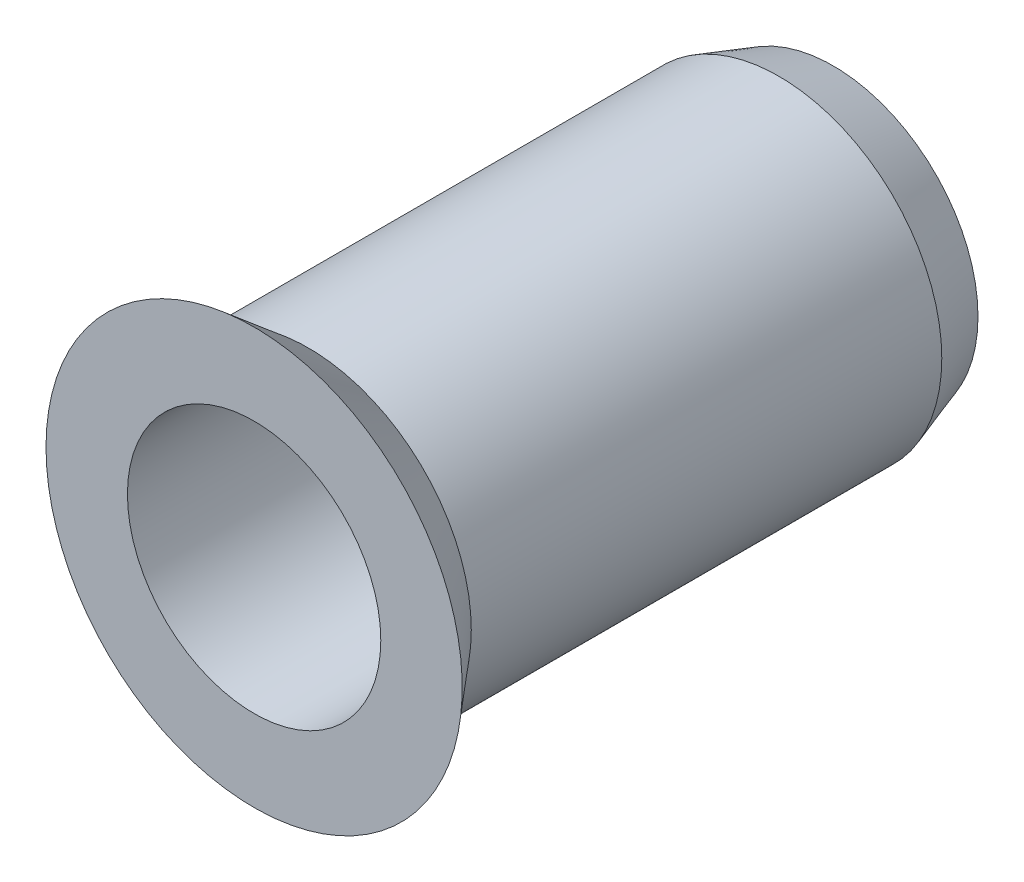
ISO-10303-21;
HEADER;
FILE_DESCRIPTION(('STEP AP214'),'2;1');
FILE_NAME('part.step','',(''),(''),'','','');
FILE_SCHEMA(('AUTOMOTIVE_DESIGN { 1 0 10303 214 1 1 1 1 }'));
ENDSEC;
DATA;
#1=APPLICATION_CONTEXT('core data for automotive mechanical design processes');
#2=APPLICATION_PROTOCOL_DEFINITION('international standard','automotive_design',2000,#1);
#3=PRODUCT_CONTEXT('',#1,'mechanical');
#4=PRODUCT('Part','Part','',(#3));
#5=PRODUCT_RELATED_PRODUCT_CATEGORY('part','',(#4));
#6=PRODUCT_DEFINITION_FORMATION('','',#4);
#7=PRODUCT_DEFINITION_CONTEXT('part definition',#1,'design');
#8=PRODUCT_DEFINITION('design','',#6,#7);
#9=PRODUCT_DEFINITION_SHAPE('','',#8);
#10=(LENGTH_UNIT() NAMED_UNIT(*) SI_UNIT(.MILLI.,.METRE.));
#11=(NAMED_UNIT(*) PLANE_ANGLE_UNIT() SI_UNIT($,.RADIAN.));
#12=(NAMED_UNIT(*) SI_UNIT($,.STERADIAN.) SOLID_ANGLE_UNIT());
#13=UNCERTAINTY_MEASURE_WITH_UNIT(LENGTH_MEASURE(1.E-05),#10,'distance_accuracy_value','');
#14=(GEOMETRIC_REPRESENTATION_CONTEXT(3) GLOBAL_UNCERTAINTY_ASSIGNED_CONTEXT((#13)) GLOBAL_UNIT_ASSIGNED_CONTEXT((#10,
#11,#12)) REPRESENTATION_CONTEXT('',''));
#15=CARTESIAN_POINT('',(0.,0.,0.));
#16=DIRECTION('',(0.,0.,1.));
#17=DIRECTION('',(1.,0.,0.));
#18=AXIS2_PLACEMENT_3D('',#15,#16,#17);
#19=CARTESIAN_POINT('',(0.,0.,16.0000000009859));
#20=DIRECTION('',(0.,0.,-1.));
#21=DIRECTION('',(-1.,0.,0.));
#22=AXIS2_PLACEMENT_3D('',#19,#20,#21);
#23=CYLINDRICAL_SURFACE('',#22,3.5);
#24=CARTESIAN_POINT('',(0.,0.,9.00000000000001));
#25=DIRECTION('',(0.,0.,-1.));
#26=DIRECTION('',(-1.,0.,0.));
#27=AXIS2_PLACEMENT_3D('',#24,#25,#26);
#28=CIRCLE('',#27,3.5);
#29=CARTESIAN_POINT('',(-3.5,0.,9.00000000000001));
#30=VERTEX_POINT('',#29);
#31=EDGE_CURVE('E10',#30,#30,#28,.T.);
#32=ORIENTED_EDGE('',*,*,#31,.T.);
#33=EDGE_LOOP('',(#32));
#34=FACE_BOUND('',#33,.T.);
#35=CARTESIAN_POINT('',(0.,0.,16.0000000020375));
#36=DIRECTION('',(0.,0.,-1.));
#37=DIRECTION('',(-1.,0.,0.));
#38=AXIS2_PLACEMENT_3D('',#35,#36,#37);
#39=CIRCLE('',#38,3.5);
#40=CARTESIAN_POINT('',(-3.5,0.,16.0000000020375));
#41=VERTEX_POINT('',#40);
#42=EDGE_CURVE('E78',#41,#41,#39,.T.);
#43=ORIENTED_EDGE('',*,*,#42,.F.);
#44=EDGE_LOOP('',(#43));
#45=FACE_BOUND('',#44,.T.);
#46=ADVANCED_FACE('F40',(#34,#45),#23,.F.);
#47=CARTESIAN_POINT('',(0.,0.,9.00000000000001));
#48=DIRECTION('',(0.,0.,1.));
#49=DIRECTION('',(1.,0.,0.));
#50=AXIS2_PLACEMENT_3D('',#47,#48,#49);
#51=CONICAL_SURFACE('',#50,3.5,1.02974425753921);
#52=CARTESIAN_POINT('',(0.,0.,8.39913937983283));
#53=DIRECTION('',(0.,0.,-1.));
#54=DIRECTION('',(-1.,0.,0.));
#55=AXIS2_PLACEMENT_3D('',#52,#53,#54);
#56=CIRCLE('',#55,2.50000000067985);
#57=CARTESIAN_POINT('',(-2.50000000067985,0.,8.39913937983283));
#58=VERTEX_POINT('',#57);
#59=EDGE_CURVE('E47',#58,#58,#56,.T.);
#60=ORIENTED_EDGE('',*,*,#59,.T.);
#61=EDGE_LOOP('',(#60));
#62=FACE_BOUND('',#61,.T.);
#63=ORIENTED_EDGE('',*,*,#31,.F.);
#64=EDGE_LOOP('',(#63));
#65=FACE_BOUND('',#64,.T.);
#66=ADVANCED_FACE('F89',(#62,#65),#51,.F.);
#67=CARTESIAN_POINT('',(0.,0.,16.0000000009859));
#68=DIRECTION('',(0.,0.,-1.));
#69=DIRECTION('',(-1.,0.,0.));
#70=AXIS2_PLACEMENT_3D('',#67,#68,#69);
#71=CYLINDRICAL_SURFACE('',#70,2.50000000067985);
#72=CARTESIAN_POINT('',(0.,0.,1.00000000088585));
#73=DIRECTION('',(0.,0.,-1.));
#74=DIRECTION('',(-1.,0.,0.));
#75=AXIS2_PLACEMENT_3D('',#72,#73,#74);
#76=CIRCLE('',#75,2.50000000067985);
#77=CARTESIAN_POINT('',(-2.50000000067985,0.,1.00000000088585));
#78=VERTEX_POINT('',#77);
#79=EDGE_CURVE('E55',#78,#78,#76,.T.);
#80=ORIENTED_EDGE('',*,*,#79,.T.);
#81=EDGE_LOOP('',(#80));
#82=FACE_BOUND('',#81,.T.);
#83=ORIENTED_EDGE('',*,*,#59,.F.);
#84=EDGE_LOOP('',(#83));
#85=FACE_BOUND('',#84,.T.);
#86=ADVANCED_FACE('F92',(#82,#85),#71,.F.);
#87=CARTESIAN_POINT('',(0.,0.,1.00000000088585));
#88=DIRECTION('',(0.,0.,-1.));
#89=DIRECTION('',(-1.,0.,0.));
#90=AXIS2_PLACEMENT_3D('',#87,#88,#89);
#91=CONICAL_SURFACE('',#90,2.50000000067985,0.785398163397448);
#92=CARTESIAN_POINT('',(0.,0.,8.81072992342524E-10));
#93=DIRECTION('',(0.,0.,-1.));
#94=DIRECTION('',(-1.,0.,0.));
#95=AXIS2_PLACEMENT_3D('',#92,#93,#94);
#96=CIRCLE('',#95,3.50000000068462);
#97=CARTESIAN_POINT('',(-3.50000000068462,0.,8.81072992342524E-10));
#98=VERTEX_POINT('',#97);
#99=EDGE_CURVE('E61',#98,#98,#96,.T.);
#100=ORIENTED_EDGE('',*,*,#99,.T.);
#101=EDGE_LOOP('',(#100));
#102=FACE_BOUND('',#101,.T.);
#103=ORIENTED_EDGE('',*,*,#79,.F.);
#104=EDGE_LOOP('',(#103));
#105=FACE_BOUND('',#104,.T.);
#106=ADVANCED_FACE('F95',(#102,#105),#91,.F.);
#107=CARTESIAN_POINT('',(3.50000000068462,0.,8.81072992342524E-10));
#108=DIRECTION('',(0.,0.,-1.));
#109=DIRECTION('',(-1.,0.,0.));
#110=AXIS2_PLACEMENT_3D('',#107,#108,#109);
#111=PLANE('',#110);
#112=CARTESIAN_POINT('',(0.,0.,8.81072992342524E-10));
#113=DIRECTION('',(0.,0.,-1.));
#114=DIRECTION('',(-1.,0.,0.));
#115=AXIS2_PLACEMENT_3D('',#112,#113,#114);
#116=CIRCLE('',#115,4.00000000130755);
#117=CARTESIAN_POINT('',(-4.00000000130755,0.,8.81072992342524E-10));
#118=VERTEX_POINT('',#117);
#119=EDGE_CURVE('E66',#118,#118,#116,.T.);
#120=ORIENTED_EDGE('',*,*,#119,.T.);
#121=EDGE_LOOP('',(#120));
#122=FACE_BOUND('',#121,.T.);
#123=ORIENTED_EDGE('',*,*,#99,.F.);
#124=EDGE_LOOP('',(#123));
#125=FACE_BOUND('',#124,.T.);
#126=ADVANCED_FACE('F102',(#122,#125),#111,.T.);
#127=CARTESIAN_POINT('',(0.,0.,8.81072992342524E-10));
#128=DIRECTION('',(0.,0.,1.));
#129=DIRECTION('',(1.,0.,0.));
#130=AXIS2_PLACEMENT_3D('',#127,#128,#129);
#131=CONICAL_SURFACE('',#130,4.00000000130755,0.321750554004332);
#132=CARTESIAN_POINT('',(0.,0.,1.5000000010516));
#133=DIRECTION('',(0.,0.,-1.));
#134=DIRECTION('',(-1.,0.,0.));
#135=AXIS2_PLACEMENT_3D('',#132,#133,#134);
#136=CIRCLE('',#135,4.50000000071054);
#137=CARTESIAN_POINT('',(-4.50000000071054,0.,1.5000000010516));
#138=VERTEX_POINT('',#137);
#139=EDGE_CURVE('E69',#138,#138,#136,.T.);
#140=ORIENTED_EDGE('',*,*,#139,.T.);
#141=EDGE_LOOP('',(#140));
#142=FACE_BOUND('',#141,.T.);
#143=ORIENTED_EDGE('',*,*,#119,.F.);
#144=EDGE_LOOP('',(#143));
#145=FACE_BOUND('',#144,.T.);
#146=ADVANCED_FACE('F106',(#142,#145),#131,.T.);
#147=CARTESIAN_POINT('',(0.,0.,16.0000000009859));
#148=DIRECTION('',(0.,0.,-1.));
#149=DIRECTION('',(-1.,0.,0.));
#150=AXIS2_PLACEMENT_3D('',#147,#148,#149);
#151=CYLINDRICAL_SURFACE('',#150,4.50000000071054);
#152=CARTESIAN_POINT('',(0.,0.,14.5000000010516));
#153=DIRECTION('',(0.,0.,-1.));
#154=DIRECTION('',(-1.,0.,0.));
#155=AXIS2_PLACEMENT_3D('',#152,#153,#154);
#156=CIRCLE('',#155,4.50000000071054);
#157=CARTESIAN_POINT('',(-4.50000000071054,0.,14.5000000010516));
#158=VERTEX_POINT('',#157);
#159=EDGE_CURVE('E72',#158,#158,#156,.T.);
#160=ORIENTED_EDGE('',*,*,#159,.T.);
#161=EDGE_LOOP('',(#160));
#162=FACE_BOUND('',#161,.T.);
#163=ORIENTED_EDGE('',*,*,#139,.F.);
#164=EDGE_LOOP('',(#163));
#165=FACE_BOUND('',#164,.T.);
#166=ADVANCED_FACE('F110',(#162,#165),#151,.T.);
#167=CARTESIAN_POINT('',(0.,0.,14.5000000010516));
#168=DIRECTION('',(0.,0.,1.));
#169=DIRECTION('',(1.,0.,0.));
#170=AXIS2_PLACEMENT_3D('',#167,#168,#169);
#171=CONICAL_SURFACE('',#170,4.50000000071054,0.6947382754174);
#172=CARTESIAN_POINT('',(0.,0.,16.0000000020375));
#173=DIRECTION('',(0.,0.,-1.));
#174=DIRECTION('',(-1.,0.,0.));
#175=AXIS2_PLACEMENT_3D('',#172,#173,#174);
#176=CIRCLE('',#175,5.74999999955139);
#177=CARTESIAN_POINT('',(-5.74999999955139,0.,16.0000000020375));
#178=VERTEX_POINT('',#177);
#179=EDGE_CURVE('E75',#178,#178,#176,.T.);
#180=ORIENTED_EDGE('',*,*,#179,.T.);
#181=EDGE_LOOP('',(#180));
#182=FACE_BOUND('',#181,.T.);
#183=ORIENTED_EDGE('',*,*,#159,.F.);
#184=EDGE_LOOP('',(#183));
#185=FACE_BOUND('',#184,.T.);
#186=ADVANCED_FACE('F114',(#182,#185),#171,.T.);
#187=CARTESIAN_POINT('',(5.74999999955139,0.,16.0000000020375));
#188=DIRECTION('',(0.,0.,1.));
#189=DIRECTION('',(1.,0.,0.));
#190=AXIS2_PLACEMENT_3D('',#187,#188,#189);
#191=PLANE('',#190);
#192=ORIENTED_EDGE('',*,*,#42,.T.);
#193=EDGE_LOOP('',(#192));
#194=FACE_BOUND('',#193,.T.);
#195=ORIENTED_EDGE('',*,*,#179,.F.);
#196=EDGE_LOOP('',(#195));
#197=FACE_BOUND('',#196,.T.);
#198=ADVANCED_FACE('F85',(#194,#197),#191,.T.);
#199=CLOSED_SHELL('',(#46,#66,#86,#106,#126,#146,#166,#186,#198));
#200=MANIFOLD_SOLID_BREP('B2',#199);
#201=ADVANCED_BREP_SHAPE_REPRESENTATION('',(#18,#200),#14);
#202=SHAPE_DEFINITION_REPRESENTATION(#9,#201);
ENDSEC;
END-ISO-10303-21;
